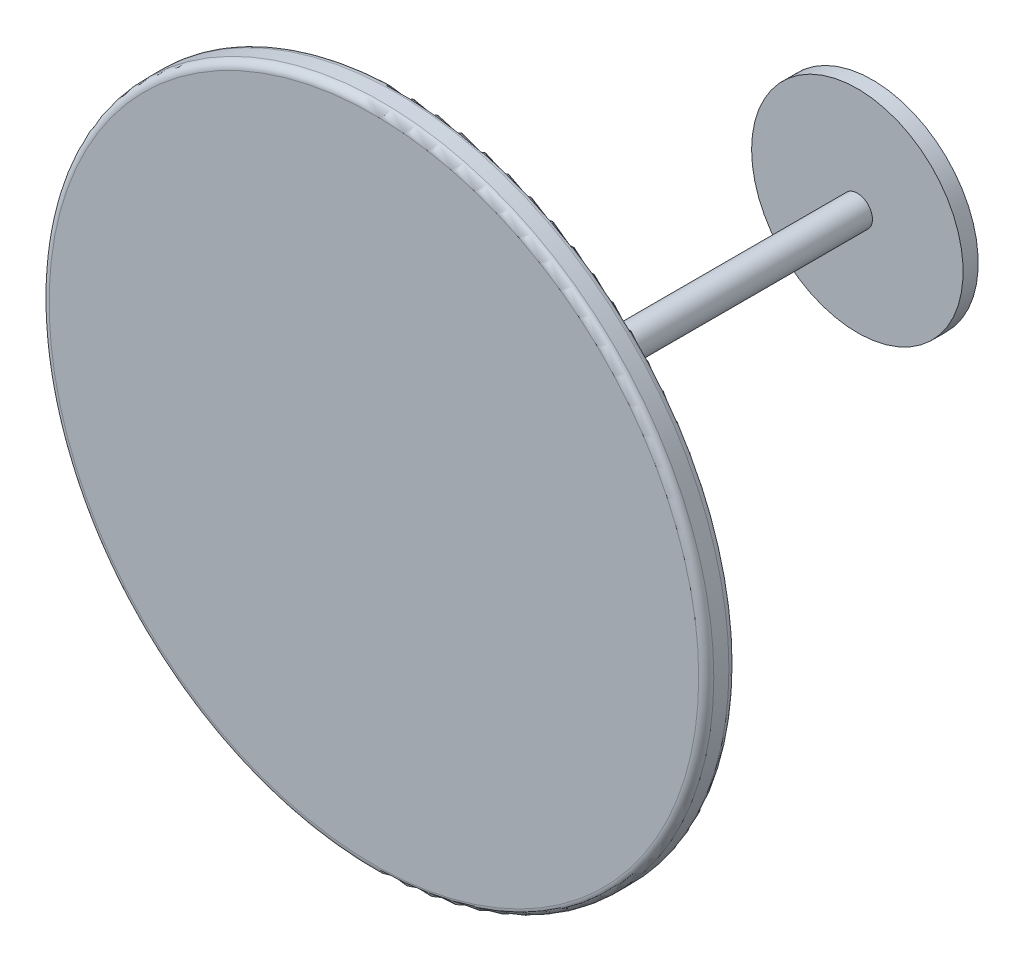
ISO-10303-21;
HEADER;
FILE_DESCRIPTION(('STEP AP214'),'2;1');
FILE_NAME('part.step','',(''),(''),'','','');
FILE_SCHEMA(('AUTOMOTIVE_DESIGN { 1 0 10303 214 1 1 1 1 }'));
ENDSEC;
DATA;
#1=APPLICATION_CONTEXT('core data for automotive mechanical design processes');
#2=APPLICATION_PROTOCOL_DEFINITION('international standard','automotive_design',2000,#1);
#3=PRODUCT_CONTEXT('',#1,'mechanical');
#4=PRODUCT('Part','Part','',(#3));
#5=PRODUCT_RELATED_PRODUCT_CATEGORY('part','',(#4));
#6=PRODUCT_DEFINITION_FORMATION('','',#4);
#7=PRODUCT_DEFINITION_CONTEXT('part definition',#1,'design');
#8=PRODUCT_DEFINITION('design','',#6,#7);
#9=PRODUCT_DEFINITION_SHAPE('','',#8);
#10=(LENGTH_UNIT() NAMED_UNIT(*) SI_UNIT(.MILLI.,.METRE.));
#11=(NAMED_UNIT(*) PLANE_ANGLE_UNIT() SI_UNIT($,.RADIAN.));
#12=(NAMED_UNIT(*) SI_UNIT($,.STERADIAN.) SOLID_ANGLE_UNIT());
#13=UNCERTAINTY_MEASURE_WITH_UNIT(LENGTH_MEASURE(1.E-05),#10,'distance_accuracy_value','');
#14=(GEOMETRIC_REPRESENTATION_CONTEXT(3) GLOBAL_UNCERTAINTY_ASSIGNED_CONTEXT((#13)) GLOBAL_UNIT_ASSIGNED_CONTEXT((#10,
#11,#12)) REPRESENTATION_CONTEXT('',''));
#15=CARTESIAN_POINT('',(0.,0.,0.));
#16=DIRECTION('',(0.,0.,1.));
#17=DIRECTION('',(1.,0.,0.));
#18=AXIS2_PLACEMENT_3D('',#15,#16,#17);
#19=CARTESIAN_POINT('',(0.,0.,0.));
#20=DIRECTION('',(0.,0.,1.));
#21=DIRECTION('',(1.,0.,0.));
#22=AXIS2_PLACEMENT_3D('',#19,#20,#21);
#23=PLANE('',#22);
#24=CARTESIAN_POINT('',(0.,0.,0.));
#25=DIRECTION('',(0.,0.,1.));
#26=DIRECTION('',(1.,0.,0.));
#27=AXIS2_PLACEMENT_3D('',#24,#25,#26);
#28=CIRCLE('',#27,273.05);
#29=CARTESIAN_POINT('',(273.05,0.,0.));
#30=VERTEX_POINT('',#29);
#31=EDGE_CURVE('E10',#30,#30,#28,.F.);
#32=ORIENTED_EDGE('',*,*,#31,.T.);
#33=EDGE_LOOP('',(#32));
#34=FACE_BOUND('',#33,.T.);
#35=CARTESIAN_POINT('',(0.,0.,0.));
#36=DIRECTION('',(0.,0.,1.));
#37=DIRECTION('',(1.,0.,0.));
#38=AXIS2_PLACEMENT_3D('',#35,#36,#37);
#39=CIRCLE('',#38,12.7);
#40=CARTESIAN_POINT('',(12.7,0.,0.));
#41=VERTEX_POINT('',#40);
#42=EDGE_CURVE('E54',#41,#41,#39,.F.);
#43=ORIENTED_EDGE('',*,*,#42,.F.);
#44=EDGE_LOOP('',(#43));
#45=FACE_BOUND('',#44,.T.);
#46=ADVANCED_FACE('F34',(#34,#45),#23,.F.);
#47=CARTESIAN_POINT('',(0.,0.,25.4));
#48=DIRECTION('',(0.,0.,-1.));
#49=DIRECTION('',(-1.,0.,0.));
#50=AXIS2_PLACEMENT_3D('',#47,#48,#49);
#51=CYLINDRICAL_SURFACE('',#50,279.4);
#52=CARTESIAN_POINT('',(0.,0.,19.05));
#53=DIRECTION('',(0.,0.,1.));
#54=DIRECTION('',(1.,0.,0.));
#55=AXIS2_PLACEMENT_3D('',#52,#53,#54);
#56=CIRCLE('',#55,279.4);
#57=CARTESIAN_POINT('',(279.4,0.,19.05));
#58=VERTEX_POINT('',#57);
#59=EDGE_CURVE('E41',#58,#58,#56,.F.);
#60=ORIENTED_EDGE('',*,*,#59,.T.);
#61=EDGE_LOOP('',(#60));
#62=FACE_BOUND('',#61,.T.);
#63=CARTESIAN_POINT('',(0.,0.,6.35));
#64=DIRECTION('',(0.,0.,1.));
#65=DIRECTION('',(1.,0.,0.));
#66=AXIS2_PLACEMENT_3D('',#63,#64,#65);
#67=CIRCLE('',#66,279.4);
#68=CARTESIAN_POINT('',(279.4,0.,6.35));
#69=VERTEX_POINT('',#68);
#70=EDGE_CURVE('E45',#69,#69,#67,.T.);
#71=ORIENTED_EDGE('',*,*,#70,.T.);
#72=EDGE_LOOP('',(#71));
#73=FACE_BOUND('',#72,.T.);
#74=ADVANCED_FACE('F90',(#62,#73),#51,.T.);
#75=CARTESIAN_POINT('',(0.,0.,25.4));
#76=DIRECTION('',(0.,0.,1.));
#77=DIRECTION('',(1.,0.,0.));
#78=AXIS2_PLACEMENT_3D('',#75,#76,#77);
#79=PLANE('',#78);
#80=CARTESIAN_POINT('',(0.,0.,25.4));
#81=DIRECTION('',(0.,0.,1.));
#82=DIRECTION('',(1.,0.,0.));
#83=AXIS2_PLACEMENT_3D('',#80,#81,#82);
#84=CIRCLE('',#83,273.05);
#85=CARTESIAN_POINT('',(273.05,0.,25.4));
#86=VERTEX_POINT('',#85);
#87=EDGE_CURVE('E49',#86,#86,#84,.T.);
#88=ORIENTED_EDGE('',*,*,#87,.T.);
#89=EDGE_LOOP('',(#88));
#90=FACE_BOUND('',#89,.T.);
#91=ADVANCED_FACE('F85',(#90),#79,.T.);
#92=CARTESIAN_POINT('',(0.,0.,-381.));
#93=DIRECTION('',(0.,0.,1.));
#94=DIRECTION('',(1.,0.,0.));
#95=AXIS2_PLACEMENT_3D('',#92,#93,#94);
#96=CYLINDRICAL_SURFACE('',#95,12.7);
#97=CARTESIAN_POINT('',(0.,0.,-381.));
#98=DIRECTION('',(0.,0.,-1.));
#99=DIRECTION('',(-1.,0.,0.));
#100=AXIS2_PLACEMENT_3D('',#97,#98,#99);
#101=CIRCLE('',#100,12.7);
#102=CARTESIAN_POINT('',(-12.7,0.,-381.));
#103=VERTEX_POINT('',#102);
#104=EDGE_CURVE('E57',#103,#103,#101,.T.);
#105=ORIENTED_EDGE('',*,*,#104,.F.);
#106=EDGE_LOOP('',(#105));
#107=FACE_BOUND('',#106,.T.);
#108=ORIENTED_EDGE('',*,*,#42,.T.);
#109=EDGE_LOOP('',(#108));
#110=FACE_BOUND('',#109,.T.);
#111=ADVANCED_FACE('F81',(#107,#110),#96,.T.);
#112=CARTESIAN_POINT('',(0.,0.,19.05));
#113=DIRECTION('',(0.,0.,1.));
#114=DIRECTION('',(1.,0.,0.));
#115=AXIS2_PLACEMENT_3D('',#112,#113,#114);
#116=TOROIDAL_SURFACE('',#115,273.05,6.35);
#117=ORIENTED_EDGE('',*,*,#59,.F.);
#118=EDGE_LOOP('',(#117));
#119=FACE_BOUND('',#118,.T.);
#120=ORIENTED_EDGE('',*,*,#87,.F.);
#121=EDGE_LOOP('',(#120));
#122=FACE_BOUND('',#121,.T.);
#123=ADVANCED_FACE('F84',(#119,#122),#116,.T.);
#124=CARTESIAN_POINT('',(0.,0.,6.35));
#125=DIRECTION('',(0.,0.,1.));
#126=DIRECTION('',(1.,0.,0.));
#127=AXIS2_PLACEMENT_3D('',#124,#125,#126);
#128=TOROIDAL_SURFACE('',#127,273.05,6.35);
#129=ORIENTED_EDGE('',*,*,#31,.F.);
#130=EDGE_LOOP('',(#129));
#131=FACE_BOUND('',#130,.T.);
#132=ORIENTED_EDGE('',*,*,#70,.F.);
#133=EDGE_LOOP('',(#132));
#134=FACE_BOUND('',#133,.T.);
#135=ADVANCED_FACE('F36',(#131,#134),#128,.T.);
#136=CARTESIAN_POINT('',(0.,0.,-381.));
#137=DIRECTION('',(0.,0.,-1.));
#138=DIRECTION('',(-1.,0.,0.));
#139=AXIS2_PLACEMENT_3D('',#136,#137,#138);
#140=PLANE('',#139);
#141=CARTESIAN_POINT('',(0.,0.,-381.));
#142=DIRECTION('',(0.,0.,-1.));
#143=DIRECTION('',(-1.,0.,0.));
#144=AXIS2_PLACEMENT_3D('',#141,#142,#143);
#145=CIRCLE('',#144,88.9);
#146=CARTESIAN_POINT('',(-88.9,0.,-381.));
#147=VERTEX_POINT('',#146);
#148=EDGE_CURVE('E61',#147,#147,#145,.T.);
#149=ORIENTED_EDGE('',*,*,#148,.F.);
#150=EDGE_LOOP('',(#149));
#151=FACE_BOUND('',#150,.T.);
#152=ORIENTED_EDGE('',*,*,#104,.T.);
#153=EDGE_LOOP('',(#152));
#154=FACE_BOUND('',#153,.T.);
#155=ADVANCED_FACE('F72',(#151,#154),#140,.F.);
#156=CARTESIAN_POINT('',(0.,0.,-393.7));
#157=DIRECTION('',(0.,0.,1.));
#158=DIRECTION('',(1.,0.,0.));
#159=AXIS2_PLACEMENT_3D('',#156,#157,#158);
#160=CYLINDRICAL_SURFACE('',#159,88.9);
#161=CARTESIAN_POINT('',(0.,0.,-393.7));
#162=DIRECTION('',(0.,0.,-1.));
#163=DIRECTION('',(-1.,0.,0.));
#164=AXIS2_PLACEMENT_3D('',#161,#162,#163);
#165=CIRCLE('',#164,88.9);
#166=CARTESIAN_POINT('',(-88.9,0.,-393.7));
#167=VERTEX_POINT('',#166);
#168=EDGE_CURVE('E60',#167,#167,#165,.T.);
#169=ORIENTED_EDGE('',*,*,#168,.F.);
#170=EDGE_LOOP('',(#169));
#171=FACE_BOUND('',#170,.T.);
#172=ORIENTED_EDGE('',*,*,#148,.T.);
#173=EDGE_LOOP('',(#172));
#174=FACE_BOUND('',#173,.T.);
#175=ADVANCED_FACE('F69',(#171,#174),#160,.T.);
#176=CARTESIAN_POINT('',(0.,0.,-393.7));
#177=DIRECTION('',(0.,0.,-1.));
#178=DIRECTION('',(-1.,0.,0.));
#179=AXIS2_PLACEMENT_3D('',#176,#177,#178);
#180=PLANE('',#179);
#181=ORIENTED_EDGE('',*,*,#168,.T.);
#182=EDGE_LOOP('',(#181));
#183=FACE_BOUND('',#182,.T.);
#184=ADVANCED_FACE('F67',(#183),#180,.T.);
#185=CLOSED_SHELL('',(#46,#74,#91,#111,#123,#135,#155,#175,#184));
#186=MANIFOLD_SOLID_BREP('B2',#185);
#187=ADVANCED_BREP_SHAPE_REPRESENTATION('',(#18,#186),#14);
#188=SHAPE_DEFINITION_REPRESENTATION(#9,#187);
ENDSEC;
END-ISO-10303-21;
